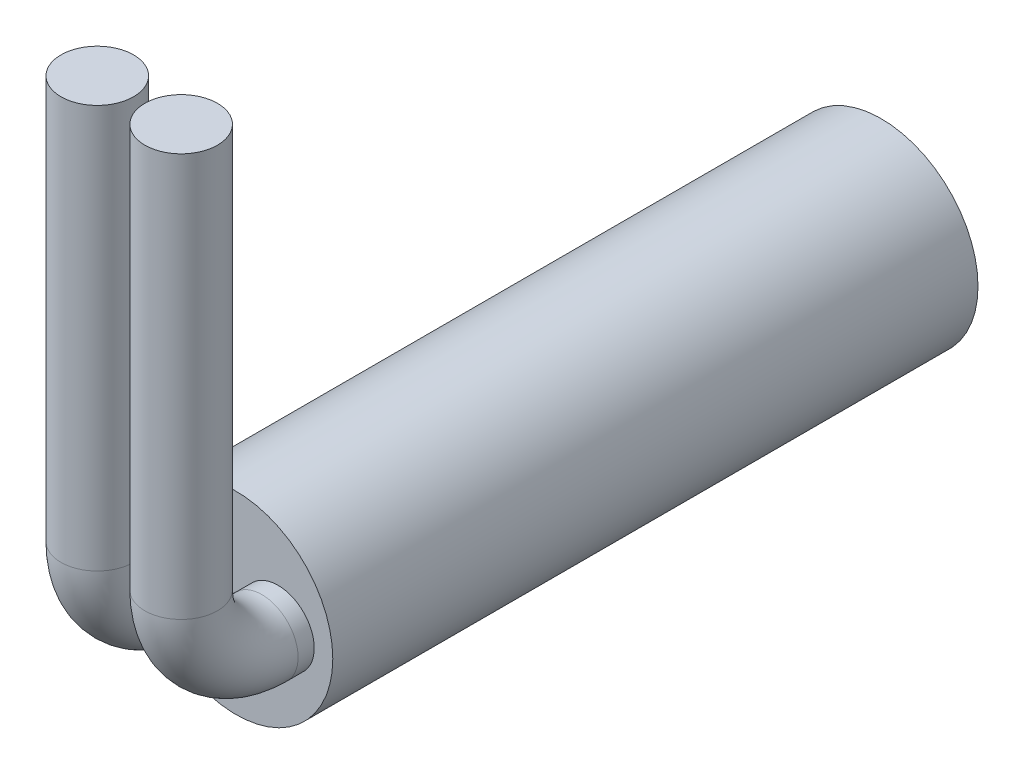
ISO-10303-21;
HEADER;
FILE_DESCRIPTION(('STEP AP214'),'2;1');
FILE_NAME('part.step','',(''),(''),'','','');
FILE_SCHEMA(('AUTOMOTIVE_DESIGN { 1 0 10303 214 1 1 1 1 }'));
ENDSEC;
DATA;
#1=APPLICATION_CONTEXT('core data for automotive mechanical design processes');
#2=APPLICATION_PROTOCOL_DEFINITION('international standard','automotive_design',2000,#1);
#3=PRODUCT_CONTEXT('',#1,'mechanical');
#4=PRODUCT('Part','Part','',(#3));
#5=PRODUCT_RELATED_PRODUCT_CATEGORY('part','',(#4));
#6=PRODUCT_DEFINITION_FORMATION('','',#4);
#7=PRODUCT_DEFINITION_CONTEXT('part definition',#1,'design');
#8=PRODUCT_DEFINITION('design','',#6,#7);
#9=PRODUCT_DEFINITION_SHAPE('','',#8);
#10=(LENGTH_UNIT() NAMED_UNIT(*) SI_UNIT(.MILLI.,.METRE.));
#11=(NAMED_UNIT(*) PLANE_ANGLE_UNIT() SI_UNIT($,.RADIAN.));
#12=(NAMED_UNIT(*) SI_UNIT($,.STERADIAN.) SOLID_ANGLE_UNIT());
#13=UNCERTAINTY_MEASURE_WITH_UNIT(LENGTH_MEASURE(1.E-05),#10,'distance_accuracy_value','');
#14=(GEOMETRIC_REPRESENTATION_CONTEXT(3) GLOBAL_UNCERTAINTY_ASSIGNED_CONTEXT((#13)) GLOBAL_UNIT_ASSIGNED_CONTEXT((#10,
#11,#12)) REPRESENTATION_CONTEXT('',''));
#15=CARTESIAN_POINT('',(0.,0.,0.));
#16=DIRECTION('',(0.,0.,1.));
#17=DIRECTION('',(1.,0.,0.));
#18=AXIS2_PLACEMENT_3D('',#15,#16,#17);
#19=CARTESIAN_POINT('',(1.3,2.5,3.));
#20=DIRECTION('',(0.,1.,0.));
#21=DIRECTION('',(0.,0.,1.));
#22=AXIS2_PLACEMENT_3D('',#19,#20,#21);
#23=CYLINDRICAL_SURFACE('',#22,1.125);
#24=CARTESIAN_POINT('',(1.3,2.5,3.));
#25=DIRECTION('',(0.,1.,0.));
#26=DIRECTION('',(1.,0.,0.));
#27=AXIS2_PLACEMENT_3D('',#24,#25,#26);
#28=CIRCLE('',#27,1.125);
#29=CARTESIAN_POINT('',(1.3,2.5,4.125));
#30=VERTEX_POINT('',#29);
#31=EDGE_CURVE('E49',#30,#30,#28,.T.);
#32=ORIENTED_EDGE('',*,*,#31,.T.);
#33=EDGE_LOOP('',(#32));
#34=FACE_BOUND('',#33,.T.);
#35=CARTESIAN_POINT('',(1.3,15.,2.99999999999999));
#36=DIRECTION('',(0.,1.,0.));
#37=DIRECTION('',(1.,0.,0.));
#38=AXIS2_PLACEMENT_3D('',#35,#36,#37);
#39=CIRCLE('',#38,1.125);
#40=CARTESIAN_POINT('',(2.425,15.,2.99999999999999));
#41=VERTEX_POINT('',#40);
#42=EDGE_CURVE('E11',#41,#41,#39,.T.);
#43=ORIENTED_EDGE('',*,*,#42,.F.);
#44=EDGE_LOOP('',(#43));
#45=FACE_BOUND('',#44,.T.);
#46=ADVANCED_FACE('F43',(#34,#45),#23,.T.);
#47=CARTESIAN_POINT('',(1.3,2.5,0.5));
#48=DIRECTION('',(-1.,0.,0.));
#49=DIRECTION('',(0.,0.,1.));
#50=AXIS2_PLACEMENT_3D('',#47,#48,#49);
#51=TOROIDAL_SURFACE('',#50,2.5,1.125);
#52=CARTESIAN_POINT('',(1.3,0.,0.499999999999999));
#53=DIRECTION('',(0.,0.,1.));
#54=DIRECTION('',(1.,0.,0.));
#55=AXIS2_PLACEMENT_3D('',#52,#53,#54);
#56=CIRCLE('',#55,1.125);
#57=CARTESIAN_POINT('',(1.3,-1.125,0.499999999999999));
#58=VERTEX_POINT('',#57);
#59=EDGE_CURVE('E53',#58,#58,#56,.T.);
#60=CARTESIAN_POINT('',(1.3,2.5,0.5));
#61=DIRECTION('',(-1.,0.,0.));
#62=DIRECTION('',(0.,0.,1.));
#63=AXIS2_PLACEMENT_3D('',#60,#61,#62);
#64=CIRCLE('',#63,3.625);
#65=EDGE_CURVE('',#58,#30,#64,.T.);
#66=ORIENTED_EDGE('',*,*,#59,.T.);
#67=ORIENTED_EDGE('',*,*,#31,.F.);
#68=ORIENTED_EDGE('',*,*,#65,.T.);
#69=ORIENTED_EDGE('',*,*,#65,.F.);
#70=EDGE_LOOP('',(#66,#68,#67,#69));
#71=FACE_BOUND('',#70,.T.);
#72=ADVANCED_FACE('F75',(#71),#51,.T.);
#73=CARTESIAN_POINT('',(1.3,0.,0.499999999999999));
#74=DIRECTION('',(0.,0.,-1.));
#75=DIRECTION('',(-1.,0.,0.));
#76=AXIS2_PLACEMENT_3D('',#73,#74,#75);
#77=CYLINDRICAL_SURFACE('',#76,1.125);
#78=ORIENTED_EDGE('',*,*,#59,.F.);
#79=EDGE_LOOP('',(#78));
#80=FACE_BOUND('',#79,.T.);
#81=CARTESIAN_POINT('',(1.3,0.,0.));
#82=DIRECTION('',(0.,0.,1.));
#83=DIRECTION('',(1.,0.,0.));
#84=AXIS2_PLACEMENT_3D('',#81,#82,#83);
#85=CIRCLE('',#84,1.125);
#86=CARTESIAN_POINT('',(2.425,0.,0.));
#87=VERTEX_POINT('',#86);
#88=EDGE_CURVE('E57',#87,#87,#85,.T.);
#89=ORIENTED_EDGE('',*,*,#88,.T.);
#90=EDGE_LOOP('',(#89));
#91=FACE_BOUND('',#90,.T.);
#92=ADVANCED_FACE('F63',(#80,#91),#77,.T.);
#93=CARTESIAN_POINT('',(1.3,15.,2.99999999999999));
#94=DIRECTION('',(0.,1.,0.));
#95=DIRECTION('',(1.,0.,0.));
#96=AXIS2_PLACEMENT_3D('',#93,#94,#95);
#97=PLANE('',#96);
#98=ORIENTED_EDGE('',*,*,#42,.T.);
#99=EDGE_LOOP('',(#98));
#100=FACE_BOUND('',#99,.T.);
#101=ADVANCED_FACE('F67',(#100),#97,.T.);
#102=CARTESIAN_POINT('',(1.3,0.,0.));
#103=DIRECTION('',(0.,0.,1.));
#104=DIRECTION('',(1.,0.,0.));
#105=AXIS2_PLACEMENT_3D('',#102,#103,#104);
#106=PLANE('',#105);
#107=ORIENTED_EDGE('',*,*,#88,.F.);
#108=EDGE_LOOP('',(#107));
#109=FACE_BOUND('',#108,.T.);
#110=ADVANCED_FACE('F65',(#109),#106,.F.);
#111=CLOSED_SHELL('',(#46,#72,#92,#101,#110));
#112=MANIFOLD_SOLID_BREP('B2',#111);
#113=CARTESIAN_POINT('',(-1.3,2.5,3.));
#114=DIRECTION('',(0.,1.,0.));
#115=DIRECTION('',(0.,0.,1.));
#116=AXIS2_PLACEMENT_3D('',#113,#114,#115);
#117=CYLINDRICAL_SURFACE('',#116,1.125);
#118=CARTESIAN_POINT('',(-1.3,2.5,3.));
#119=DIRECTION('',(0.,1.,0.));
#120=DIRECTION('',(1.,0.,0.));
#121=AXIS2_PLACEMENT_3D('',#118,#119,#120);
#122=CIRCLE('',#121,1.125);
#123=CARTESIAN_POINT('',(-1.3,2.5,4.125));
#124=VERTEX_POINT('',#123);
#125=EDGE_CURVE('E126',#124,#124,#122,.T.);
#126=ORIENTED_EDGE('',*,*,#125,.T.);
#127=EDGE_LOOP('',(#126));
#128=FACE_BOUND('',#127,.T.);
#129=CARTESIAN_POINT('',(-1.3,15.,2.99999999999999));
#130=DIRECTION('',(0.,1.,0.));
#131=DIRECTION('',(1.,0.,0.));
#132=AXIS2_PLACEMENT_3D('',#129,#130,#131);
#133=CIRCLE('',#132,1.125);
#134=CARTESIAN_POINT('',(-0.175,15.,2.99999999999999));
#135=VERTEX_POINT('',#134);
#136=EDGE_CURVE('E42',#135,#135,#133,.T.);
#137=ORIENTED_EDGE('',*,*,#136,.F.);
#138=EDGE_LOOP('',(#137));
#139=FACE_BOUND('',#138,.T.);
#140=ADVANCED_FACE('F120',(#128,#139),#117,.T.);
#141=CARTESIAN_POINT('',(-1.3,2.5,0.5));
#142=DIRECTION('',(-1.,0.,0.));
#143=DIRECTION('',(0.,0.,1.));
#144=AXIS2_PLACEMENT_3D('',#141,#142,#143);
#145=TOROIDAL_SURFACE('',#144,2.5,1.125);
#146=CARTESIAN_POINT('',(-1.3,0.,0.5));
#147=DIRECTION('',(0.,0.,1.));
#148=DIRECTION('',(1.,0.,0.));
#149=AXIS2_PLACEMENT_3D('',#146,#147,#148);
#150=CIRCLE('',#149,1.125);
#151=CARTESIAN_POINT('',(-1.3,-1.125,0.5));
#152=VERTEX_POINT('',#151);
#153=EDGE_CURVE('E130',#152,#152,#150,.T.);
#154=CARTESIAN_POINT('',(-1.3,2.5,0.5));
#155=DIRECTION('',(-1.,0.,0.));
#156=DIRECTION('',(0.,0.,1.));
#157=AXIS2_PLACEMENT_3D('',#154,#155,#156);
#158=CIRCLE('',#157,3.625);
#159=EDGE_CURVE('',#152,#124,#158,.T.);
#160=ORIENTED_EDGE('',*,*,#153,.T.);
#161=ORIENTED_EDGE('',*,*,#125,.F.);
#162=ORIENTED_EDGE('',*,*,#159,.T.);
#163=ORIENTED_EDGE('',*,*,#159,.F.);
#164=EDGE_LOOP('',(#160,#162,#161,#163));
#165=FACE_BOUND('',#164,.T.);
#166=ADVANCED_FACE('F152',(#165),#145,.T.);
#167=CARTESIAN_POINT('',(-1.3,0.,0.5));
#168=DIRECTION('',(0.,0.,-1.));
#169=DIRECTION('',(-1.,0.,0.));
#170=AXIS2_PLACEMENT_3D('',#167,#168,#169);
#171=CYLINDRICAL_SURFACE('',#170,1.125);
#172=ORIENTED_EDGE('',*,*,#153,.F.);
#173=EDGE_LOOP('',(#172));
#174=FACE_BOUND('',#173,.T.);
#175=CARTESIAN_POINT('',(-1.3,0.,0.));
#176=DIRECTION('',(0.,0.,1.));
#177=DIRECTION('',(1.,0.,0.));
#178=AXIS2_PLACEMENT_3D('',#175,#176,#177);
#179=CIRCLE('',#178,1.125);
#180=CARTESIAN_POINT('',(-0.175,0.,0.));
#181=VERTEX_POINT('',#180);
#182=EDGE_CURVE('E134',#181,#181,#179,.T.);
#183=ORIENTED_EDGE('',*,*,#182,.T.);
#184=EDGE_LOOP('',(#183));
#185=FACE_BOUND('',#184,.T.);
#186=ADVANCED_FACE('F140',(#174,#185),#171,.T.);
#187=CARTESIAN_POINT('',(-1.3,15.,2.99999999999999));
#188=DIRECTION('',(0.,1.,0.));
#189=DIRECTION('',(1.,0.,0.));
#190=AXIS2_PLACEMENT_3D('',#187,#188,#189);
#191=PLANE('',#190);
#192=ORIENTED_EDGE('',*,*,#136,.T.);
#193=EDGE_LOOP('',(#192));
#194=FACE_BOUND('',#193,.T.);
#195=ADVANCED_FACE('F144',(#194),#191,.T.);
#196=CARTESIAN_POINT('',(-1.3,0.,0.));
#197=DIRECTION('',(0.,0.,1.));
#198=DIRECTION('',(1.,0.,0.));
#199=AXIS2_PLACEMENT_3D('',#196,#197,#198);
#200=PLANE('',#199);
#201=ORIENTED_EDGE('',*,*,#182,.F.);
#202=EDGE_LOOP('',(#201));
#203=FACE_BOUND('',#202,.T.);
#204=ADVANCED_FACE('F142',(#203),#200,.F.);
#205=CLOSED_SHELL('',(#140,#166,#186,#195,#204));
#206=MANIFOLD_SOLID_BREP('B6',#205);
#207=CARTESIAN_POINT('',(0.,0.,-20.));
#208=DIRECTION('',(0.,0.,1.));
#209=DIRECTION('',(1.,0.,0.));
#210=AXIS2_PLACEMENT_3D('',#207,#208,#209);
#211=CYLINDRICAL_SURFACE('',#210,3.);
#212=CARTESIAN_POINT('',(0.,0.,-20.));
#213=DIRECTION('',(0.,0.,1.));
#214=DIRECTION('',(1.,0.,0.));
#215=AXIS2_PLACEMENT_3D('',#212,#213,#214);
#216=CIRCLE('',#215,3.);
#217=CARTESIAN_POINT('',(3.,0.,-20.));
#218=VERTEX_POINT('',#217);
#219=EDGE_CURVE('E119',#218,#218,#216,.T.);
#220=ORIENTED_EDGE('',*,*,#219,.T.);
#221=EDGE_LOOP('',(#220));
#222=FACE_BOUND('',#221,.T.);
#223=CARTESIAN_POINT('',(0.,0.,0.));
#224=DIRECTION('',(0.,0.,1.));
#225=DIRECTION('',(1.,0.,0.));
#226=AXIS2_PLACEMENT_3D('',#223,#224,#225);
#227=CIRCLE('',#226,3.);
#228=CARTESIAN_POINT('',(3.,0.,0.));
#229=VERTEX_POINT('',#228);
#230=EDGE_CURVE('E193',#229,#229,#227,.T.);
#231=ORIENTED_EDGE('',*,*,#230,.F.);
#232=EDGE_LOOP('',(#231));
#233=FACE_BOUND('',#232,.T.);
#234=ADVANCED_FACE('F190',(#222,#233),#211,.T.);
#235=CARTESIAN_POINT('',(0.,0.,-20.));
#236=DIRECTION('',(0.,0.,1.));
#237=DIRECTION('',(1.,0.,0.));
#238=AXIS2_PLACEMENT_3D('',#235,#236,#237);
#239=PLANE('',#238);
#240=ORIENTED_EDGE('',*,*,#219,.F.);
#241=EDGE_LOOP('',(#240));
#242=FACE_BOUND('',#241,.T.);
#243=ADVANCED_FACE('F205',(#242),#239,.F.);
#244=CARTESIAN_POINT('',(0.,0.,0.));
#245=DIRECTION('',(0.,0.,1.));
#246=DIRECTION('',(1.,0.,0.));
#247=AXIS2_PLACEMENT_3D('',#244,#245,#246);
#248=PLANE('',#247);
#249=ORIENTED_EDGE('',*,*,#230,.T.);
#250=EDGE_LOOP('',(#249));
#251=FACE_BOUND('',#250,.T.);
#252=ADVANCED_FACE('F202',(#251),#248,.T.);
#253=CLOSED_SHELL('',(#234,#243,#252));
#254=MANIFOLD_SOLID_BREP('B37',#253);
#255=ADVANCED_BREP_SHAPE_REPRESENTATION('',(#18,#112,#206,#254),#14);
#256=SHAPE_DEFINITION_REPRESENTATION(#9,#255);
ENDSEC;
END-ISO-10303-21;
